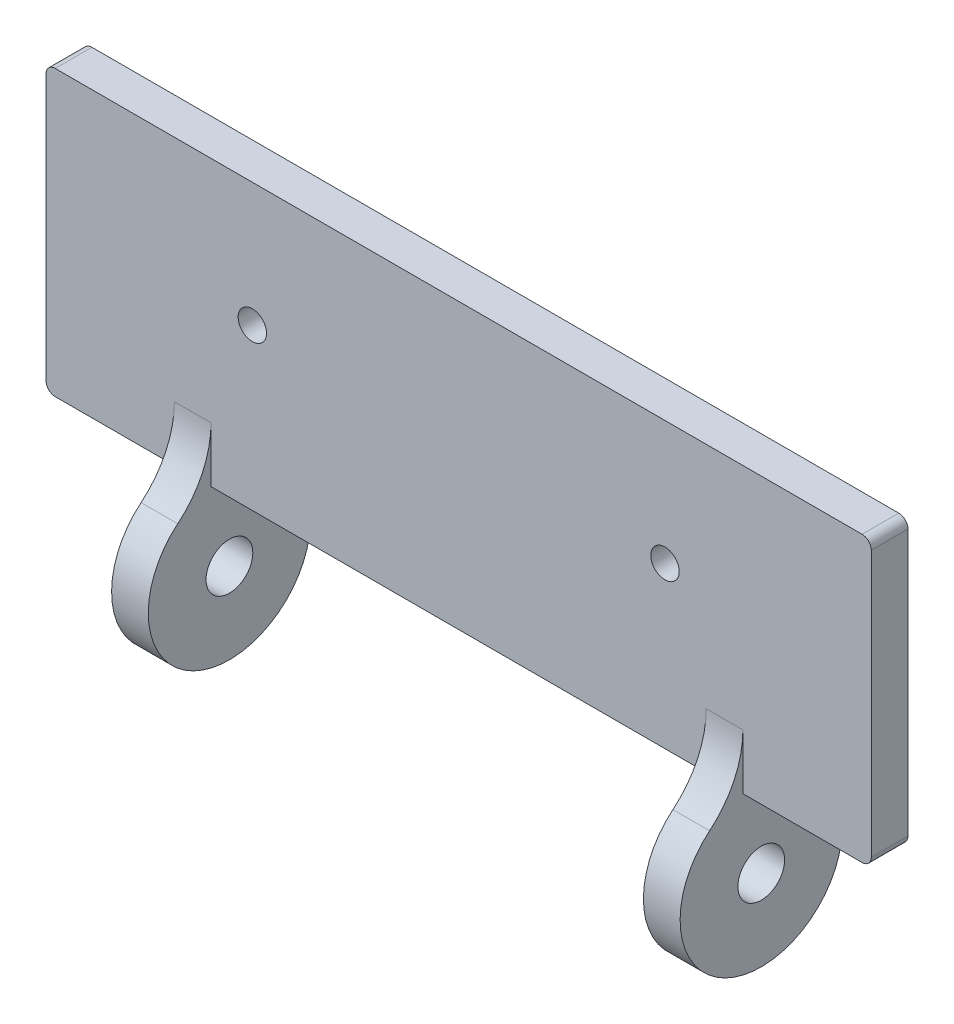
ISO-10303-21;
HEADER;
FILE_DESCRIPTION(('STEP AP214'),'2;1');
FILE_NAME('part.step','',(''),(''),'','','');
FILE_SCHEMA(('AUTOMOTIVE_DESIGN { 1 0 10303 214 1 1 1 1 }'));
ENDSEC;
DATA;
#1=APPLICATION_CONTEXT('core data for automotive mechanical design processes');
#2=APPLICATION_PROTOCOL_DEFINITION('international standard','automotive_design',2000,#1);
#3=PRODUCT_CONTEXT('',#1,'mechanical');
#4=PRODUCT('Part','Part','',(#3));
#5=PRODUCT_RELATED_PRODUCT_CATEGORY('part','',(#4));
#6=PRODUCT_DEFINITION_FORMATION('','',#4);
#7=PRODUCT_DEFINITION_CONTEXT('part definition',#1,'design');
#8=PRODUCT_DEFINITION('design','',#6,#7);
#9=PRODUCT_DEFINITION_SHAPE('','',#8);
#10=(LENGTH_UNIT() NAMED_UNIT(*) SI_UNIT(.MILLI.,.METRE.));
#11=(NAMED_UNIT(*) PLANE_ANGLE_UNIT() SI_UNIT($,.RADIAN.));
#12=(NAMED_UNIT(*) SI_UNIT($,.STERADIAN.) SOLID_ANGLE_UNIT());
#13=UNCERTAINTY_MEASURE_WITH_UNIT(LENGTH_MEASURE(1.E-05),#10,'distance_accuracy_value','');
#14=(GEOMETRIC_REPRESENTATION_CONTEXT(3) GLOBAL_UNCERTAINTY_ASSIGNED_CONTEXT((#13)) GLOBAL_UNIT_ASSIGNED_CONTEXT((#10,
#11,#12)) REPRESENTATION_CONTEXT('',''));
#15=CARTESIAN_POINT('',(0.,0.,0.));
#16=DIRECTION('',(0.,0.,1.));
#17=DIRECTION('',(1.,0.,0.));
#18=AXIS2_PLACEMENT_3D('',#15,#16,#17);
#19=CARTESIAN_POINT('',(40.9315281880334,-9.50897456248087,4.));
#20=DIRECTION('',(0.,1.,0.));
#21=DIRECTION('',(-1.,0.,0.));
#22=AXIS2_PLACEMENT_3D('',#19,#20,#21);
#23=PLANE('',#22);
#24=DIRECTION('',(1.,0.,0.));
#25=VECTOR('',#24,1.);
#26=CARTESIAN_POINT('',(40.9315281880334,-9.50897456248087,4.));
#27=LINE('',#26,#25);
#28=CARTESIAN_POINT('',(-48.0684718119666,-9.50897456248088,4.));
#29=VERTEX_POINT('',#28);
#30=CARTESIAN_POINT('',(-35.0684718119666,-9.50897456248088,4.));
#31=VERTEX_POINT('',#30);
#32=EDGE_CURVE('E343',#29,#31,#27,.T.);
#33=ORIENTED_EDGE('',*,*,#32,.F.);
#34=DIRECTION('',(0.,0.,-1.));
#35=VECTOR('',#34,1.);
#36=CARTESIAN_POINT('',(-48.0684718119666,-9.50897456248088,4.));
#37=LINE('',#36,#35);
#38=CARTESIAN_POINT('',(-48.0684718119666,-9.50897456248088,0.));
#39=VERTEX_POINT('',#38);
#40=EDGE_CURVE('E274',#29,#39,#37,.T.);
#41=ORIENTED_EDGE('',*,*,#40,.T.);
#42=DIRECTION('',(1.,0.,0.));
#43=VECTOR('',#42,1.);
#44=CARTESIAN_POINT('',(40.9315281880334,-9.50897456248087,0.));
#45=LINE('',#44,#43);
#46=CARTESIAN_POINT('',(-35.0684718119666,-9.50897456248088,0.));
#47=VERTEX_POINT('',#46);
#48=EDGE_CURVE('E192',#39,#47,#45,.T.);
#49=ORIENTED_EDGE('',*,*,#48,.T.);
#50=DIRECTION('',(0.,0.,-1.));
#51=VECTOR('',#50,1.);
#52=CARTESIAN_POINT('',(-35.0684718119666,-9.50897456248088,4.));
#53=LINE('',#52,#51);
#54=EDGE_CURVE('E401',#31,#47,#53,.T.);
#55=ORIENTED_EDGE('',*,*,#54,.F.);
#56=EDGE_LOOP('',(#33,#41,#49,#55));
#57=FACE_BOUND('',#56,.T.);
#58=ADVANCED_FACE('F40',(#57),#23,.F.);
#59=CARTESIAN_POINT('',(0.,0.,4.));
#60=DIRECTION('',(0.,0.,-1.));
#61=DIRECTION('',(-1.,0.,0.));
#62=AXIS2_PLACEMENT_3D('',#59,#60,#61);
#63=PLANE('',#62);
#64=CARTESIAN_POINT('',(-26.5684718119666,7.99102543751913,4.));
#65=DIRECTION('',(0.,0.,1.));
#66=DIRECTION('',(1.,0.,0.));
#67=AXIS2_PLACEMENT_3D('',#64,#65,#66);
#68=CIRCLE('',#67,1.55);
#69=CARTESIAN_POINT('',(-25.0184718119666,7.99102543751913,4.));
#70=VERTEX_POINT('',#69);
#71=EDGE_CURVE('E430',#70,#70,#68,.T.);
#72=ORIENTED_EDGE('',*,*,#71,.F.);
#73=EDGE_LOOP('',(#72));
#74=FACE_BOUND('',#73,.T.);
#75=CARTESIAN_POINT('',(18.4315281880334,7.99102543751913,4.));
#76=DIRECTION('',(0.,0.,1.));
#77=DIRECTION('',(1.,0.,0.));
#78=AXIS2_PLACEMENT_3D('',#75,#76,#77);
#79=CIRCLE('',#78,1.55);
#80=CARTESIAN_POINT('',(19.9815281880334,7.99102543751913,4.));
#81=VERTEX_POINT('',#80);
#82=EDGE_CURVE('E422',#81,#81,#79,.T.);
#83=ORIENTED_EDGE('',*,*,#82,.F.);
#84=EDGE_LOOP('',(#83));
#85=FACE_BOUND('',#84,.T.);
#86=DIRECTION('',(0.,-1.,0.));
#87=VECTOR('',#86,1.);
#88=CARTESIAN_POINT('',(-49.0684718119666,21.4910254375191,4.));
#89=LINE('',#88,#87);
#90=CARTESIAN_POINT('',(-49.0684718119666,20.4910254375191,4.));
#91=VERTEX_POINT('',#90);
#92=CARTESIAN_POINT('',(-49.0684718119666,-8.50897456248088,4.));
#93=VERTEX_POINT('',#92);
#94=EDGE_CURVE('E360',#91,#93,#89,.T.);
#95=ORIENTED_EDGE('',*,*,#94,.T.);
#96=CARTESIAN_POINT('',(-48.0684718119666,-8.50897456248088,4.));
#97=DIRECTION('',(0.,0.,-1.));
#98=DIRECTION('',(-1.,0.,0.));
#99=AXIS2_PLACEMENT_3D('',#96,#97,#98);
#100=CIRCLE('',#99,1.);
#101=EDGE_CURVE('E305',#93,#29,#100,.F.);
#102=ORIENTED_EDGE('',*,*,#101,.T.);
#103=ORIENTED_EDGE('',*,*,#32,.T.);
#104=DIRECTION('',(0.,-1.,0.));
#105=VECTOR('',#104,1.);
#106=CARTESIAN_POINT('',(-35.0684718119666,0.,4.));
#107=LINE('',#106,#105);
#108=CARTESIAN_POINT('',(-35.0684718119666,-3.48299043424948,4.));
#109=VERTEX_POINT('',#108);
#110=EDGE_CURVE('E394',#109,#31,#107,.T.);
#111=ORIENTED_EDGE('',*,*,#110,.F.);
#112=DIRECTION('',(1.,0.,0.));
#113=VECTOR('',#112,1.);
#114=CARTESIAN_POINT('',(0.,-3.48299043424947,4.));
#115=LINE('',#114,#113);
#116=CARTESIAN_POINT('',(-31.0684718119666,-3.48299043424948,4.));
#117=VERTEX_POINT('',#116);
#118=EDGE_CURVE('E215',#109,#117,#115,.T.);
#119=ORIENTED_EDGE('',*,*,#118,.T.);
#120=DIRECTION('',(0.,-1.,0.));
#121=VECTOR('',#120,1.);
#122=CARTESIAN_POINT('',(-31.0684718119666,0.,4.));
#123=LINE('',#122,#121);
#124=CARTESIAN_POINT('',(-31.0684718119666,-9.50897456248088,4.));
#125=VERTEX_POINT('',#124);
#126=EDGE_CURVE('E202',#117,#125,#123,.T.);
#127=ORIENTED_EDGE('',*,*,#126,.T.);
#128=CARTESIAN_POINT('',(22.9315281880334,-9.50897456248087,4.));
#129=VERTEX_POINT('',#128);
#130=EDGE_CURVE('E199',#125,#129,#27,.T.);
#131=ORIENTED_EDGE('',*,*,#130,.T.);
#132=DIRECTION('',(0.,-1.,0.));
#133=VECTOR('',#132,1.);
#134=CARTESIAN_POINT('',(22.9315281880334,0.,4.));
#135=LINE('',#134,#133);
#136=CARTESIAN_POINT('',(22.9315281880334,-3.48299043424947,4.));
#137=VERTEX_POINT('',#136);
#138=EDGE_CURVE('E333',#137,#129,#135,.T.);
#139=ORIENTED_EDGE('',*,*,#138,.F.);
#140=DIRECTION('',(1.,0.,0.));
#141=VECTOR('',#140,1.);
#142=CARTESIAN_POINT('',(0.,-3.48299043424948,4.));
#143=LINE('',#142,#141);
#144=CARTESIAN_POINT('',(26.9315281880334,-3.48299043424947,4.));
#145=VERTEX_POINT('',#144);
#146=EDGE_CURVE('E224',#137,#145,#143,.T.);
#147=ORIENTED_EDGE('',*,*,#146,.T.);
#148=DIRECTION('',(0.,-1.,0.));
#149=VECTOR('',#148,1.);
#150=CARTESIAN_POINT('',(26.9315281880334,0.,4.));
#151=LINE('',#150,#149);
#152=CARTESIAN_POINT('',(26.9315281880334,-9.50897456248087,4.));
#153=VERTEX_POINT('',#152);
#154=EDGE_CURVE('E374',#145,#153,#151,.T.);
#155=ORIENTED_EDGE('',*,*,#154,.T.);
#156=CARTESIAN_POINT('',(39.9315281880334,-9.50897456248087,4.));
#157=VERTEX_POINT('',#156);
#158=EDGE_CURVE('E354',#153,#157,#27,.T.);
#159=ORIENTED_EDGE('',*,*,#158,.T.);
#160=CARTESIAN_POINT('',(39.9315281880334,-8.50897456248087,4.));
#161=DIRECTION('',(0.,0.,-1.));
#162=DIRECTION('',(-1.,0.,0.));
#163=AXIS2_PLACEMENT_3D('',#160,#161,#162);
#164=CIRCLE('',#163,1.);
#165=CARTESIAN_POINT('',(40.9315281880334,-8.50897456248087,4.));
#166=VERTEX_POINT('',#165);
#167=EDGE_CURVE('E299',#157,#166,#164,.F.);
#168=ORIENTED_EDGE('',*,*,#167,.T.);
#169=DIRECTION('',(0.,1.,0.));
#170=VECTOR('',#169,1.);
#171=CARTESIAN_POINT('',(40.9315281880334,21.4910254375191,4.));
#172=LINE('',#171,#170);
#173=CARTESIAN_POINT('',(40.9315281880334,20.4910254375191,4.));
#174=VERTEX_POINT('',#173);
#175=EDGE_CURVE('E326',#166,#174,#172,.T.);
#176=ORIENTED_EDGE('',*,*,#175,.T.);
#177=CARTESIAN_POINT('',(39.9315281880334,20.4910254375191,4.));
#178=DIRECTION('',(0.,0.,-1.));
#179=DIRECTION('',(-1.,0.,0.));
#180=AXIS2_PLACEMENT_3D('',#177,#178,#179);
#181=CIRCLE('',#180,1.);
#182=CARTESIAN_POINT('',(39.9315281880334,21.4910254375191,4.));
#183=VERTEX_POINT('',#182);
#184=EDGE_CURVE('E63',#174,#183,#181,.F.);
#185=ORIENTED_EDGE('',*,*,#184,.T.);
#186=DIRECTION('',(-1.,0.,0.));
#187=VECTOR('',#186,1.);
#188=CARTESIAN_POINT('',(40.9315281880334,21.4910254375191,4.));
#189=LINE('',#188,#187);
#190=CARTESIAN_POINT('',(-48.0684718119666,21.4910254375191,4.));
#191=VERTEX_POINT('',#190);
#192=EDGE_CURVE('E364',#183,#191,#189,.T.);
#193=ORIENTED_EDGE('',*,*,#192,.T.);
#194=CARTESIAN_POINT('',(-48.0684718119666,20.4910254375191,4.));
#195=DIRECTION('',(0.,0.,-1.));
#196=DIRECTION('',(-1.,0.,0.));
#197=AXIS2_PLACEMENT_3D('',#194,#195,#196);
#198=CIRCLE('',#197,1.);
#199=EDGE_CURVE('E302',#191,#91,#198,.F.);
#200=ORIENTED_EDGE('',*,*,#199,.T.);
#201=EDGE_LOOP('',(#95,#102,#103,#111,#119,#127,#131,#139,#147,#155,#159,#168,#176,#185,#193,#200));
#202=FACE_BOUND('',#201,.T.);
#203=ADVANCED_FACE('F448',(#74,#85,#202),#63,.F.);
#204=CARTESIAN_POINT('',(0.,0.,0.));
#205=DIRECTION('',(0.,0.,-1.));
#206=DIRECTION('',(-1.,0.,0.));
#207=AXIS2_PLACEMENT_3D('',#204,#205,#206);
#208=PLANE('',#207);
#209=CARTESIAN_POINT('',(-26.5684718119666,7.99102543751913,0.));
#210=DIRECTION('',(0.,0.,1.));
#211=DIRECTION('',(1.,0.,0.));
#212=AXIS2_PLACEMENT_3D('',#209,#210,#211);
#213=CIRCLE('',#212,1.55);
#214=CARTESIAN_POINT('',(-25.0184718119666,7.99102543751913,0.));
#215=VERTEX_POINT('',#214);
#216=EDGE_CURVE('E418',#215,#215,#213,.T.);
#217=ORIENTED_EDGE('',*,*,#216,.T.);
#218=EDGE_LOOP('',(#217));
#219=FACE_BOUND('',#218,.T.);
#220=CARTESIAN_POINT('',(18.4315281880334,7.99102543751913,0.));
#221=DIRECTION('',(0.,0.,1.));
#222=DIRECTION('',(1.,0.,0.));
#223=AXIS2_PLACEMENT_3D('',#220,#221,#222);
#224=CIRCLE('',#223,1.55);
#225=CARTESIAN_POINT('',(19.9815281880334,7.99102543751913,0.));
#226=VERTEX_POINT('',#225);
#227=EDGE_CURVE('E426',#226,#226,#224,.T.);
#228=ORIENTED_EDGE('',*,*,#227,.T.);
#229=EDGE_LOOP('',(#228));
#230=FACE_BOUND('',#229,.T.);
#231=ORIENTED_EDGE('',*,*,#48,.F.);
#232=CARTESIAN_POINT('',(-48.0684718119666,-8.50897456248088,0.));
#233=DIRECTION('',(0.,0.,-1.));
#234=DIRECTION('',(-1.,0.,0.));
#235=AXIS2_PLACEMENT_3D('',#232,#233,#234);
#236=CIRCLE('',#235,1.);
#237=CARTESIAN_POINT('',(-49.0684718119666,-8.50897456248088,0.));
#238=VERTEX_POINT('',#237);
#239=EDGE_CURVE('E287',#39,#238,#236,.T.);
#240=ORIENTED_EDGE('',*,*,#239,.T.);
#241=DIRECTION('',(0.,-1.,0.));
#242=VECTOR('',#241,1.);
#243=CARTESIAN_POINT('',(-49.0684718119666,21.4910254375191,0.));
#244=LINE('',#243,#242);
#245=CARTESIAN_POINT('',(-49.0684718119666,20.4910254375191,0.));
#246=VERTEX_POINT('',#245);
#247=EDGE_CURVE('E337',#246,#238,#244,.T.);
#248=ORIENTED_EDGE('',*,*,#247,.F.);
#249=CARTESIAN_POINT('',(-48.0684718119666,20.4910254375191,0.));
#250=DIRECTION('',(0.,0.,-1.));
#251=DIRECTION('',(-1.,0.,0.));
#252=AXIS2_PLACEMENT_3D('',#249,#250,#251);
#253=CIRCLE('',#252,1.);
#254=CARTESIAN_POINT('',(-48.0684718119666,21.4910254375191,0.));
#255=VERTEX_POINT('',#254);
#256=EDGE_CURVE('E284',#246,#255,#253,.T.);
#257=ORIENTED_EDGE('',*,*,#256,.T.);
#258=DIRECTION('',(-1.,0.,0.));
#259=VECTOR('',#258,1.);
#260=CARTESIAN_POINT('',(40.9315281880334,21.4910254375191,0.));
#261=LINE('',#260,#259);
#262=CARTESIAN_POINT('',(39.9315281880334,21.4910254375191,0.));
#263=VERTEX_POINT('',#262);
#264=EDGE_CURVE('E332',#263,#255,#261,.T.);
#265=ORIENTED_EDGE('',*,*,#264,.F.);
#266=CARTESIAN_POINT('',(39.9315281880334,20.4910254375191,0.));
#267=DIRECTION('',(0.,0.,-1.));
#268=DIRECTION('',(-1.,0.,0.));
#269=AXIS2_PLACEMENT_3D('',#266,#267,#268);
#270=CIRCLE('',#269,1.);
#271=CARTESIAN_POINT('',(40.9315281880334,20.4910254375191,0.));
#272=VERTEX_POINT('',#271);
#273=EDGE_CURVE('E278',#263,#272,#270,.T.);
#274=ORIENTED_EDGE('',*,*,#273,.T.);
#275=DIRECTION('',(0.,1.,0.));
#276=VECTOR('',#275,1.);
#277=CARTESIAN_POINT('',(40.9315281880334,21.4910254375191,0.));
#278=LINE('',#277,#276);
#279=CARTESIAN_POINT('',(40.9315281880334,-8.50897456248087,0.));
#280=VERTEX_POINT('',#279);
#281=EDGE_CURVE('E324',#280,#272,#278,.T.);
#282=ORIENTED_EDGE('',*,*,#281,.F.);
#283=CARTESIAN_POINT('',(39.9315281880334,-8.50897456248087,0.));
#284=DIRECTION('',(0.,0.,-1.));
#285=DIRECTION('',(-1.,0.,0.));
#286=AXIS2_PLACEMENT_3D('',#283,#284,#285);
#287=CIRCLE('',#286,1.);
#288=CARTESIAN_POINT('',(39.9315281880334,-9.50897456248087,0.));
#289=VERTEX_POINT('',#288);
#290=EDGE_CURVE('E281',#280,#289,#287,.T.);
#291=ORIENTED_EDGE('',*,*,#290,.T.);
#292=CARTESIAN_POINT('',(26.9315281880334,-9.50897456248088,0.));
#293=VERTEX_POINT('',#292);
#294=EDGE_CURVE('E193',#293,#289,#45,.T.);
#295=ORIENTED_EDGE('',*,*,#294,.F.);
#296=DIRECTION('',(0.,-1.,0.));
#297=VECTOR('',#296,1.);
#298=CARTESIAN_POINT('',(26.9315281880334,0.,0.));
#299=LINE('',#298,#297);
#300=CARTESIAN_POINT('',(26.9315281880334,-7.93416886545859,0.));
#301=VERTEX_POINT('',#300);
#302=EDGE_CURVE('E217',#301,#293,#299,.T.);
#303=ORIENTED_EDGE('',*,*,#302,.F.);
#304=DIRECTION('',(-1.,0.,0.));
#305=VECTOR('',#304,1.);
#306=CARTESIAN_POINT('',(22.9315281880334,-7.93416886545859,0.));
#307=LINE('',#306,#305);
#308=CARTESIAN_POINT('',(22.9315281880334,-7.93416886545859,0.));
#309=VERTEX_POINT('',#308);
#310=EDGE_CURVE('E252',#301,#309,#307,.T.);
#311=ORIENTED_EDGE('',*,*,#310,.T.);
#312=DIRECTION('',(0.,-1.,0.));
#313=VECTOR('',#312,1.);
#314=CARTESIAN_POINT('',(22.9315281880334,0.,0.));
#315=LINE('',#314,#313);
#316=CARTESIAN_POINT('',(22.9315281880334,-9.50897456248087,0.));
#317=VERTEX_POINT('',#316);
#318=EDGE_CURVE('E187',#309,#317,#315,.T.);
#319=ORIENTED_EDGE('',*,*,#318,.T.);
#320=CARTESIAN_POINT('',(-31.0684718119666,-9.50897456248088,0.));
#321=VERTEX_POINT('',#320);
#322=EDGE_CURVE('E178',#321,#317,#45,.T.);
#323=ORIENTED_EDGE('',*,*,#322,.F.);
#324=DIRECTION('',(0.,-1.,0.));
#325=VECTOR('',#324,1.);
#326=CARTESIAN_POINT('',(-31.0684718119666,0.,0.));
#327=LINE('',#326,#325);
#328=CARTESIAN_POINT('',(-31.0684718119666,-7.93416886545859,0.));
#329=VERTEX_POINT('',#328);
#330=EDGE_CURVE('E184',#329,#321,#327,.T.);
#331=ORIENTED_EDGE('',*,*,#330,.F.);
#332=DIRECTION('',(-1.,0.,0.));
#333=VECTOR('',#332,1.);
#334=CARTESIAN_POINT('',(-35.0684718119666,-7.9341688654586,0.));
#335=LINE('',#334,#333);
#336=CARTESIAN_POINT('',(-35.0684718119666,-7.9341688654586,0.));
#337=VERTEX_POINT('',#336);
#338=EDGE_CURVE('E255',#329,#337,#335,.T.);
#339=ORIENTED_EDGE('',*,*,#338,.T.);
#340=DIRECTION('',(0.,-1.,0.));
#341=VECTOR('',#340,1.);
#342=CARTESIAN_POINT('',(-35.0684718119666,0.,0.));
#343=LINE('',#342,#341);
#344=EDGE_CURVE('E210',#337,#47,#343,.T.);
#345=ORIENTED_EDGE('',*,*,#344,.T.);
#346=EDGE_LOOP('',(#231,#240,#248,#257,#265,#274,#282,#291,#295,#303,#311,#319,#323,#331,#339,#345));
#347=FACE_BOUND('',#346,.T.);
#348=ADVANCED_FACE('F181',(#219,#230,#347),#208,.T.);
#349=ORIENTED_EDGE('',*,*,#130,.F.);
#350=DIRECTION('',(0.,0.,-1.));
#351=VECTOR('',#350,1.);
#352=CARTESIAN_POINT('',(-31.0684718119666,-9.50897456248088,4.));
#353=LINE('',#352,#351);
#354=EDGE_CURVE('E197',#125,#321,#353,.T.);
#355=ORIENTED_EDGE('',*,*,#354,.T.);
#356=ORIENTED_EDGE('',*,*,#322,.T.);
#357=DIRECTION('',(0.,0.,-1.));
#358=VECTOR('',#357,1.);
#359=CARTESIAN_POINT('',(22.9315281880334,-9.50897456248087,4.));
#360=LINE('',#359,#358);
#361=EDGE_CURVE('E340',#129,#317,#360,.T.);
#362=ORIENTED_EDGE('',*,*,#361,.F.);
#363=EDGE_LOOP('',(#349,#355,#356,#362));
#364=FACE_BOUND('',#363,.T.);
#365=ADVANCED_FACE('F198',(#364),#23,.F.);
#366=CARTESIAN_POINT('',(40.9315281880334,21.4910254375191,4.));
#367=DIRECTION('',(-1.,0.,0.));
#368=DIRECTION('',(0.,-1.,0.));
#369=AXIS2_PLACEMENT_3D('',#366,#367,#368);
#370=PLANE('',#369);
#371=ORIENTED_EDGE('',*,*,#175,.F.);
#372=DIRECTION('',(0.,0.,-1.));
#373=VECTOR('',#372,1.);
#374=CARTESIAN_POINT('',(40.9315281880334,-8.50897456248087,4.));
#375=LINE('',#374,#373);
#376=EDGE_CURVE('E49',#166,#280,#375,.T.);
#377=ORIENTED_EDGE('',*,*,#376,.T.);
#378=ORIENTED_EDGE('',*,*,#281,.T.);
#379=DIRECTION('',(0.,0.,-1.));
#380=VECTOR('',#379,1.);
#381=CARTESIAN_POINT('',(40.9315281880334,20.4910254375191,4.));
#382=LINE('',#381,#380);
#383=EDGE_CURVE('E314',#272,#174,#382,.F.);
#384=ORIENTED_EDGE('',*,*,#383,.T.);
#385=EDGE_LOOP('',(#371,#377,#378,#384));
#386=FACE_BOUND('',#385,.T.);
#387=ADVANCED_FACE('F323',(#386),#370,.F.);
#388=CARTESIAN_POINT('',(40.9315281880334,21.4910254375191,4.));
#389=DIRECTION('',(0.,-1.,0.));
#390=DIRECTION('',(1.,0.,0.));
#391=AXIS2_PLACEMENT_3D('',#388,#389,#390);
#392=PLANE('',#391);
#393=ORIENTED_EDGE('',*,*,#264,.T.);
#394=DIRECTION('',(0.,0.,-1.));
#395=VECTOR('',#394,1.);
#396=CARTESIAN_POINT('',(-48.0684718119666,21.4910254375191,4.));
#397=LINE('',#396,#395);
#398=EDGE_CURVE('E56',#255,#191,#397,.F.);
#399=ORIENTED_EDGE('',*,*,#398,.T.);
#400=ORIENTED_EDGE('',*,*,#192,.F.);
#401=DIRECTION('',(0.,0.,-1.));
#402=VECTOR('',#401,1.);
#403=CARTESIAN_POINT('',(39.9315281880334,21.4910254375191,4.));
#404=LINE('',#403,#402);
#405=EDGE_CURVE('E308',#183,#263,#404,.T.);
#406=ORIENTED_EDGE('',*,*,#405,.T.);
#407=EDGE_LOOP('',(#393,#399,#400,#406));
#408=FACE_BOUND('',#407,.T.);
#409=ADVANCED_FACE('F486',(#408),#392,.F.);
#410=CARTESIAN_POINT('',(-49.0684718119666,21.4910254375191,4.));
#411=DIRECTION('',(1.,0.,0.));
#412=DIRECTION('',(0.,1.,0.));
#413=AXIS2_PLACEMENT_3D('',#410,#411,#412);
#414=PLANE('',#413);
#415=ORIENTED_EDGE('',*,*,#247,.T.);
#416=DIRECTION('',(0.,0.,-1.));
#417=VECTOR('',#416,1.);
#418=CARTESIAN_POINT('',(-49.0684718119666,-8.50897456248088,4.));
#419=LINE('',#418,#417);
#420=EDGE_CURVE('E294',#238,#93,#419,.F.);
#421=ORIENTED_EDGE('',*,*,#420,.T.);
#422=ORIENTED_EDGE('',*,*,#94,.F.);
#423=DIRECTION('',(0.,0.,-1.));
#424=VECTOR('',#423,1.);
#425=CARTESIAN_POINT('',(-49.0684718119666,20.4910254375191,4.));
#426=LINE('',#425,#424);
#427=EDGE_CURVE('E290',#91,#246,#426,.T.);
#428=ORIENTED_EDGE('',*,*,#427,.T.);
#429=EDGE_LOOP('',(#415,#421,#422,#428));
#430=FACE_BOUND('',#429,.T.);
#431=ADVANCED_FACE('F477',(#430),#414,.F.);
#432=ORIENTED_EDGE('',*,*,#294,.T.);
#433=DIRECTION('',(0.,0.,-1.));
#434=VECTOR('',#433,1.);
#435=CARTESIAN_POINT('',(39.9315281880334,-9.50897456248087,4.));
#436=LINE('',#435,#434);
#437=EDGE_CURVE('E11',#289,#157,#436,.F.);
#438=ORIENTED_EDGE('',*,*,#437,.T.);
#439=ORIENTED_EDGE('',*,*,#158,.F.);
#440=DIRECTION('',(0.,0.,-1.));
#441=VECTOR('',#440,1.);
#442=CARTESIAN_POINT('',(26.9315281880334,-9.50897456248087,4.));
#443=LINE('',#442,#441);
#444=EDGE_CURVE('E377',#153,#293,#443,.T.);
#445=ORIENTED_EDGE('',*,*,#444,.T.);
#446=EDGE_LOOP('',(#432,#438,#439,#445));
#447=FACE_BOUND('',#446,.T.);
#448=ADVANCED_FACE('F469',(#447),#23,.F.);
#449=CARTESIAN_POINT('',(22.9315281880334,-18.0199261498671,2.00000000000001));
#450=DIRECTION('',(1.,0.,0.));
#451=DIRECTION('',(0.,1.,0.));
#452=AXIS2_PLACEMENT_3D('',#449,#450,#451);
#453=CYLINDRICAL_SURFACE('',#452,8.85);
#454=CARTESIAN_POINT('',(22.9315281880334,-18.0199261498671,2.00000000000001));
#455=DIRECTION('',(1.,0.,0.));
#456=DIRECTION('',(0.,1.,0.));
#457=AXIS2_PLACEMENT_3D('',#454,#455,#456);
#458=CIRCLE('',#457,8.85);
#459=CARTESIAN_POINT('',(22.9315281880334,-11.1948926706514,7.63395225464191));
#460=VERTEX_POINT('',#459);
#461=CARTESIAN_POINT('',(22.9315281880334,-9.79329463216984,-1.26267281105991));
#462=VERTEX_POINT('',#461);
#463=EDGE_CURVE('E381',#460,#462,#458,.T.);
#464=ORIENTED_EDGE('',*,*,#463,.T.);
#465=DIRECTION('',(1.,0.,0.));
#466=VECTOR('',#465,1.);
#467=CARTESIAN_POINT('',(22.9315281880334,-9.79329463216984,-1.26267281105991));
#468=LINE('',#467,#466);
#469=CARTESIAN_POINT('',(26.9315281880334,-9.79329463216984,-1.26267281105991));
#470=VERTEX_POINT('',#469);
#471=EDGE_CURVE('E258',#462,#470,#468,.T.);
#472=ORIENTED_EDGE('',*,*,#471,.T.);
#473=CARTESIAN_POINT('',(26.9315281880334,-18.0199261498671,2.00000000000001));
#474=DIRECTION('',(1.,0.,0.));
#475=DIRECTION('',(0.,1.,0.));
#476=AXIS2_PLACEMENT_3D('',#473,#474,#475);
#477=CIRCLE('',#476,8.85);
#478=CARTESIAN_POINT('',(26.9315281880334,-11.1948926706514,7.63395225464191));
#479=VERTEX_POINT('',#478);
#480=EDGE_CURVE('E382',#479,#470,#477,.T.);
#481=ORIENTED_EDGE('',*,*,#480,.F.);
#482=DIRECTION('',(1.,0.,0.));
#483=VECTOR('',#482,1.);
#484=CARTESIAN_POINT('',(22.9315281880334,-11.1948926706514,7.63395225464192));
#485=LINE('',#484,#483);
#486=EDGE_CURVE('E228',#479,#460,#485,.F.);
#487=ORIENTED_EDGE('',*,*,#486,.T.);
#488=EDGE_LOOP('',(#464,#472,#481,#487));
#489=FACE_BOUND('',#488,.T.);
#490=ADVANCED_FACE('F476',(#489),#453,.T.);
#491=CARTESIAN_POINT('',(22.9315281880334,-18.0199261498671,2.00000000000001));
#492=DIRECTION('',(1.,0.,0.));
#493=DIRECTION('',(0.,1.,0.));
#494=AXIS2_PLACEMENT_3D('',#491,#492,#493);
#495=PLANE('',#494);
#496=CARTESIAN_POINT('',(22.9315281880334,-18.0199261498671,2.00000000000001));
#497=DIRECTION('',(1.,0.,0.));
#498=DIRECTION('',(0.,1.,0.));
#499=AXIS2_PLACEMENT_3D('',#496,#497,#498);
#500=CIRCLE('',#499,2.55);
#501=CARTESIAN_POINT('',(22.9315281880334,-15.4699261498671,2.00000000000001));
#502=VERTEX_POINT('',#501);
#503=EDGE_CURVE('E386',#502,#502,#500,.T.);
#504=ORIENTED_EDGE('',*,*,#503,.T.);
#505=EDGE_LOOP('',(#504));
#506=FACE_BOUND('',#505,.T.);
#507=ORIENTED_EDGE('',*,*,#463,.F.);
#508=CARTESIAN_POINT('',(22.9315281880334,-3.48299043424947,14.));
#509=DIRECTION('',(1.,0.,0.));
#510=DIRECTION('',(0.,1.,0.));
#511=AXIS2_PLACEMENT_3D('',#508,#509,#510);
#512=CIRCLE('',#511,10.);
#513=EDGE_CURVE('E237',#460,#137,#512,.T.);
#514=ORIENTED_EDGE('',*,*,#513,.T.);
#515=ORIENTED_EDGE('',*,*,#138,.T.);
#516=ORIENTED_EDGE('',*,*,#361,.T.);
#517=ORIENTED_EDGE('',*,*,#318,.F.);
#518=CARTESIAN_POINT('',(22.9315281880334,-7.93416886545859,-2.));
#519=DIRECTION('',(1.,0.,0.));
#520=DIRECTION('',(0.,1.,0.));
#521=AXIS2_PLACEMENT_3D('',#518,#519,#520);
#522=CIRCLE('',#521,2.);
#523=EDGE_CURVE('E271',#309,#462,#522,.T.);
#524=ORIENTED_EDGE('',*,*,#523,.T.);
#525=EDGE_LOOP('',(#507,#514,#515,#516,#517,#524));
#526=FACE_BOUND('',#525,.T.);
#527=ADVANCED_FACE('F483',(#506,#526),#495,.F.);
#528=CARTESIAN_POINT('',(26.9315281880334,-18.0199261498671,2.00000000000001));
#529=DIRECTION('',(1.,0.,0.));
#530=DIRECTION('',(0.,1.,0.));
#531=AXIS2_PLACEMENT_3D('',#528,#529,#530);
#532=PLANE('',#531);
#533=CARTESIAN_POINT('',(26.9315281880334,-18.0199261498671,2.00000000000001));
#534=DIRECTION('',(1.,0.,0.));
#535=DIRECTION('',(0.,1.,0.));
#536=AXIS2_PLACEMENT_3D('',#533,#534,#535);
#537=CIRCLE('',#536,2.55);
#538=CARTESIAN_POINT('',(26.9315281880334,-15.4699261498671,2.00000000000001));
#539=VERTEX_POINT('',#538);
#540=EDGE_CURVE('E390',#539,#539,#537,.T.);
#541=ORIENTED_EDGE('',*,*,#540,.F.);
#542=EDGE_LOOP('',(#541));
#543=FACE_BOUND('',#542,.T.);
#544=ORIENTED_EDGE('',*,*,#154,.F.);
#545=CARTESIAN_POINT('',(26.9315281880334,-3.48299043424947,14.));
#546=DIRECTION('',(1.,0.,0.));
#547=DIRECTION('',(0.,1.,0.));
#548=AXIS2_PLACEMENT_3D('',#545,#546,#547);
#549=CIRCLE('',#548,10.);
#550=EDGE_CURVE('E234',#145,#479,#549,.F.);
#551=ORIENTED_EDGE('',*,*,#550,.T.);
#552=ORIENTED_EDGE('',*,*,#480,.T.);
#553=CARTESIAN_POINT('',(26.9315281880334,-7.93416886545859,-2.));
#554=DIRECTION('',(1.,0.,0.));
#555=DIRECTION('',(0.,1.,0.));
#556=AXIS2_PLACEMENT_3D('',#553,#554,#555);
#557=CIRCLE('',#556,2.);
#558=EDGE_CURVE('E267',#470,#301,#557,.F.);
#559=ORIENTED_EDGE('',*,*,#558,.T.);
#560=ORIENTED_EDGE('',*,*,#302,.T.);
#561=ORIENTED_EDGE('',*,*,#444,.F.);
#562=EDGE_LOOP('',(#544,#551,#552,#559,#560,#561));
#563=FACE_BOUND('',#562,.T.);
#564=ADVANCED_FACE('F652',(#543,#563),#532,.T.);
#565=CARTESIAN_POINT('',(22.9315281880334,-18.0199261498671,2.00000000000001));
#566=DIRECTION('',(1.,0.,0.));
#567=DIRECTION('',(0.,1.,0.));
#568=AXIS2_PLACEMENT_3D('',#565,#566,#567);
#569=CYLINDRICAL_SURFACE('',#568,2.55);
#570=ORIENTED_EDGE('',*,*,#503,.F.);
#571=EDGE_LOOP('',(#570));
#572=FACE_BOUND('',#571,.T.);
#573=ORIENTED_EDGE('',*,*,#540,.T.);
#574=EDGE_LOOP('',(#573));
#575=FACE_BOUND('',#574,.T.);
#576=ADVANCED_FACE('F646',(#572,#575),#569,.F.);
#577=CARTESIAN_POINT('',(-35.0684718119666,-18.0199261498671,2.00000000000001));
#578=DIRECTION('',(1.,0.,0.));
#579=DIRECTION('',(0.,1.,0.));
#580=AXIS2_PLACEMENT_3D('',#577,#578,#579);
#581=CYLINDRICAL_SURFACE('',#580,8.85);
#582=CARTESIAN_POINT('',(-35.0684718119666,-18.0199261498671,2.00000000000001));
#583=DIRECTION('',(1.,0.,0.));
#584=DIRECTION('',(0.,1.,0.));
#585=AXIS2_PLACEMENT_3D('',#582,#583,#584);
#586=CIRCLE('',#585,8.85);
#587=CARTESIAN_POINT('',(-35.0684718119666,-11.1948926706514,7.63395225464191));
#588=VERTEX_POINT('',#587);
#589=CARTESIAN_POINT('',(-35.0684718119666,-9.79329463216984,-1.26267281105991));
#590=VERTEX_POINT('',#589);
#591=EDGE_CURVE('E203',#588,#590,#586,.T.);
#592=ORIENTED_EDGE('',*,*,#591,.T.);
#593=DIRECTION('',(1.,0.,0.));
#594=VECTOR('',#593,1.);
#595=CARTESIAN_POINT('',(-35.0684718119666,-9.79329463216984,-1.26267281105991));
#596=LINE('',#595,#594);
#597=CARTESIAN_POINT('',(-31.0684718119666,-9.79329463216984,-1.26267281105991));
#598=VERTEX_POINT('',#597);
#599=EDGE_CURVE('E248',#590,#598,#596,.T.);
#600=ORIENTED_EDGE('',*,*,#599,.T.);
#601=CARTESIAN_POINT('',(-31.0684718119666,-18.0199261498671,2.00000000000001));
#602=DIRECTION('',(1.,0.,0.));
#603=DIRECTION('',(0.,1.,0.));
#604=AXIS2_PLACEMENT_3D('',#601,#602,#603);
#605=CIRCLE('',#604,8.85);
#606=CARTESIAN_POINT('',(-31.0684718119666,-11.1948926706514,7.63395225464191));
#607=VERTEX_POINT('',#606);
#608=EDGE_CURVE('E407',#607,#598,#605,.T.);
#609=ORIENTED_EDGE('',*,*,#608,.F.);
#610=DIRECTION('',(1.,0.,0.));
#611=VECTOR('',#610,1.);
#612=CARTESIAN_POINT('',(-35.0684718119666,-11.1948926706514,7.63395225464192));
#613=LINE('',#612,#611);
#614=EDGE_CURVE('E231',#607,#588,#613,.F.);
#615=ORIENTED_EDGE('',*,*,#614,.T.);
#616=EDGE_LOOP('',(#592,#600,#609,#615));
#617=FACE_BOUND('',#616,.T.);
#618=ADVANCED_FACE('F512',(#617),#581,.T.);
#619=CARTESIAN_POINT('',(-35.0684718119666,-18.0199261498671,2.00000000000001));
#620=DIRECTION('',(1.,0.,0.));
#621=DIRECTION('',(0.,1.,0.));
#622=AXIS2_PLACEMENT_3D('',#619,#620,#621);
#623=PLANE('',#622);
#624=CARTESIAN_POINT('',(-35.0684718119666,-18.0199261498671,2.00000000000001));
#625=DIRECTION('',(1.,0.,0.));
#626=DIRECTION('',(0.,1.,0.));
#627=AXIS2_PLACEMENT_3D('',#624,#625,#626);
#628=CIRCLE('',#627,2.55);
#629=CARTESIAN_POINT('',(-35.0684718119666,-15.4699261498671,2.00000000000001));
#630=VERTEX_POINT('',#629);
#631=EDGE_CURVE('E410',#630,#630,#628,.T.);
#632=ORIENTED_EDGE('',*,*,#631,.T.);
#633=EDGE_LOOP('',(#632));
#634=FACE_BOUND('',#633,.T.);
#635=ORIENTED_EDGE('',*,*,#591,.F.);
#636=CARTESIAN_POINT('',(-35.0684718119666,-3.48299043424948,14.));
#637=DIRECTION('',(1.,0.,0.));
#638=DIRECTION('',(0.,1.,0.));
#639=AXIS2_PLACEMENT_3D('',#636,#637,#638);
#640=CIRCLE('',#639,10.);
#641=EDGE_CURVE('E244',#588,#109,#640,.T.);
#642=ORIENTED_EDGE('',*,*,#641,.T.);
#643=ORIENTED_EDGE('',*,*,#110,.T.);
#644=ORIENTED_EDGE('',*,*,#54,.T.);
#645=ORIENTED_EDGE('',*,*,#344,.F.);
#646=CARTESIAN_POINT('',(-35.0684718119666,-7.9341688654586,-2.));
#647=DIRECTION('',(1.,0.,0.));
#648=DIRECTION('',(0.,1.,0.));
#649=AXIS2_PLACEMENT_3D('',#646,#647,#648);
#650=CIRCLE('',#649,2.);
#651=EDGE_CURVE('E264',#337,#590,#650,.T.);
#652=ORIENTED_EDGE('',*,*,#651,.T.);
#653=EDGE_LOOP('',(#635,#642,#643,#644,#645,#652));
#654=FACE_BOUND('',#653,.T.);
#655=ADVANCED_FACE('F503',(#634,#654),#623,.F.);
#656=CARTESIAN_POINT('',(-31.0684718119666,-18.0199261498671,2.00000000000001));
#657=DIRECTION('',(1.,0.,0.));
#658=DIRECTION('',(0.,1.,0.));
#659=AXIS2_PLACEMENT_3D('',#656,#657,#658);
#660=PLANE('',#659);
#661=CARTESIAN_POINT('',(-31.0684718119666,-18.0199261498671,2.00000000000001));
#662=DIRECTION('',(1.,0.,0.));
#663=DIRECTION('',(0.,1.,0.));
#664=AXIS2_PLACEMENT_3D('',#661,#662,#663);
#665=CIRCLE('',#664,2.55);
#666=CARTESIAN_POINT('',(-31.0684718119666,-15.4699261498671,2.00000000000001));
#667=VERTEX_POINT('',#666);
#668=EDGE_CURVE('E414',#667,#667,#665,.T.);
#669=ORIENTED_EDGE('',*,*,#668,.F.);
#670=EDGE_LOOP('',(#669));
#671=FACE_BOUND('',#670,.T.);
#672=ORIENTED_EDGE('',*,*,#126,.F.);
#673=CARTESIAN_POINT('',(-31.0684718119666,-3.48299043424948,14.));
#674=DIRECTION('',(1.,0.,0.));
#675=DIRECTION('',(0.,1.,0.));
#676=AXIS2_PLACEMENT_3D('',#673,#674,#675);
#677=CIRCLE('',#676,10.);
#678=EDGE_CURVE('E241',#117,#607,#677,.F.);
#679=ORIENTED_EDGE('',*,*,#678,.T.);
#680=ORIENTED_EDGE('',*,*,#608,.T.);
#681=CARTESIAN_POINT('',(-31.0684718119666,-7.93416886545859,-2.));
#682=DIRECTION('',(1.,0.,0.));
#683=DIRECTION('',(0.,1.,0.));
#684=AXIS2_PLACEMENT_3D('',#681,#682,#683);
#685=CIRCLE('',#684,2.);
#686=EDGE_CURVE('E207',#598,#329,#685,.F.);
#687=ORIENTED_EDGE('',*,*,#686,.T.);
#688=ORIENTED_EDGE('',*,*,#330,.T.);
#689=ORIENTED_EDGE('',*,*,#354,.F.);
#690=EDGE_LOOP('',(#672,#679,#680,#687,#688,#689));
#691=FACE_BOUND('',#690,.T.);
#692=ADVANCED_FACE('F205',(#671,#691),#660,.T.);
#693=CARTESIAN_POINT('',(-35.0684718119666,-18.0199261498671,2.00000000000001));
#694=DIRECTION('',(1.,0.,0.));
#695=DIRECTION('',(0.,1.,0.));
#696=AXIS2_PLACEMENT_3D('',#693,#694,#695);
#697=CYLINDRICAL_SURFACE('',#696,2.55);
#698=ORIENTED_EDGE('',*,*,#631,.F.);
#699=EDGE_LOOP('',(#698));
#700=FACE_BOUND('',#699,.T.);
#701=ORIENTED_EDGE('',*,*,#668,.T.);
#702=EDGE_LOOP('',(#701));
#703=FACE_BOUND('',#702,.T.);
#704=ADVANCED_FACE('F626',(#700,#703),#697,.F.);
#705=CARTESIAN_POINT('',(22.9315281880334,-3.48299043424947,14.));
#706=DIRECTION('',(1.,0.,0.));
#707=DIRECTION('',(0.,1.,0.));
#708=AXIS2_PLACEMENT_3D('',#705,#706,#707);
#709=CYLINDRICAL_SURFACE('',#708,10.);
#710=ORIENTED_EDGE('',*,*,#513,.F.);
#711=ORIENTED_EDGE('',*,*,#486,.F.);
#712=ORIENTED_EDGE('',*,*,#550,.F.);
#713=ORIENTED_EDGE('',*,*,#146,.F.);
#714=EDGE_LOOP('',(#710,#711,#712,#713));
#715=FACE_BOUND('',#714,.T.);
#716=ADVANCED_FACE('F521',(#715),#709,.F.);
#717=CARTESIAN_POINT('',(-35.0684718119666,-3.48299043424948,14.));
#718=DIRECTION('',(1.,0.,0.));
#719=DIRECTION('',(0.,1.,0.));
#720=AXIS2_PLACEMENT_3D('',#717,#718,#719);
#721=CYLINDRICAL_SURFACE('',#720,10.);
#722=ORIENTED_EDGE('',*,*,#641,.F.);
#723=ORIENTED_EDGE('',*,*,#614,.F.);
#724=ORIENTED_EDGE('',*,*,#678,.F.);
#725=ORIENTED_EDGE('',*,*,#118,.F.);
#726=EDGE_LOOP('',(#722,#723,#724,#725));
#727=FACE_BOUND('',#726,.T.);
#728=ADVANCED_FACE('F508',(#727),#721,.F.);
#729=CARTESIAN_POINT('',(-35.0684718119666,-7.9341688654586,-2.));
#730=DIRECTION('',(1.,0.,0.));
#731=DIRECTION('',(0.,1.,0.));
#732=AXIS2_PLACEMENT_3D('',#729,#730,#731);
#733=CYLINDRICAL_SURFACE('',#732,2.);
#734=ORIENTED_EDGE('',*,*,#651,.F.);
#735=ORIENTED_EDGE('',*,*,#338,.F.);
#736=ORIENTED_EDGE('',*,*,#686,.F.);
#737=ORIENTED_EDGE('',*,*,#599,.F.);
#738=EDGE_LOOP('',(#734,#735,#736,#737));
#739=FACE_BOUND('',#738,.T.);
#740=ADVANCED_FACE('F461',(#739),#733,.F.);
#741=CARTESIAN_POINT('',(22.9315281880334,-7.93416886545859,-2.));
#742=DIRECTION('',(1.,0.,0.));
#743=DIRECTION('',(0.,1.,0.));
#744=AXIS2_PLACEMENT_3D('',#741,#742,#743);
#745=CYLINDRICAL_SURFACE('',#744,2.);
#746=ORIENTED_EDGE('',*,*,#523,.F.);
#747=ORIENTED_EDGE('',*,*,#310,.F.);
#748=ORIENTED_EDGE('',*,*,#558,.F.);
#749=ORIENTED_EDGE('',*,*,#471,.F.);
#750=EDGE_LOOP('',(#746,#747,#748,#749));
#751=FACE_BOUND('',#750,.T.);
#752=ADVANCED_FACE('F455',(#751),#745,.F.);
#753=CARTESIAN_POINT('',(18.4315281880334,7.99102543751913,0.));
#754=DIRECTION('',(0.,0.,1.));
#755=DIRECTION('',(1.,0.,0.));
#756=AXIS2_PLACEMENT_3D('',#753,#754,#755);
#757=CYLINDRICAL_SURFACE('',#756,1.55);
#758=ORIENTED_EDGE('',*,*,#227,.F.);
#759=EDGE_LOOP('',(#758));
#760=FACE_BOUND('',#759,.T.);
#761=ORIENTED_EDGE('',*,*,#82,.T.);
#762=EDGE_LOOP('',(#761));
#763=FACE_BOUND('',#762,.T.);
#764=ADVANCED_FACE('F444',(#760,#763),#757,.F.);
#765=CARTESIAN_POINT('',(-26.5684718119666,7.99102543751913,0.));
#766=DIRECTION('',(0.,0.,1.));
#767=DIRECTION('',(1.,0.,0.));
#768=AXIS2_PLACEMENT_3D('',#765,#766,#767);
#769=CYLINDRICAL_SURFACE('',#768,1.55);
#770=ORIENTED_EDGE('',*,*,#216,.F.);
#771=EDGE_LOOP('',(#770));
#772=FACE_BOUND('',#771,.T.);
#773=ORIENTED_EDGE('',*,*,#71,.T.);
#774=EDGE_LOOP('',(#773));
#775=FACE_BOUND('',#774,.T.);
#776=ADVANCED_FACE('F440',(#772,#775),#769,.F.);
#777=CARTESIAN_POINT('',(-48.0684718119666,-8.50897456248088,4.));
#778=DIRECTION('',(0.,0.,-1.));
#779=DIRECTION('',(-1.,0.,0.));
#780=AXIS2_PLACEMENT_3D('',#777,#778,#779);
#781=CYLINDRICAL_SURFACE('',#780,1.);
#782=ORIENTED_EDGE('',*,*,#101,.F.);
#783=ORIENTED_EDGE('',*,*,#420,.F.);
#784=ORIENTED_EDGE('',*,*,#239,.F.);
#785=ORIENTED_EDGE('',*,*,#40,.F.);
#786=EDGE_LOOP('',(#782,#783,#784,#785));
#787=FACE_BOUND('',#786,.T.);
#788=ADVANCED_FACE('F443',(#787),#781,.T.);
#789=CARTESIAN_POINT('',(-48.0684718119666,20.4910254375191,4.));
#790=DIRECTION('',(0.,0.,-1.));
#791=DIRECTION('',(-1.,0.,0.));
#792=AXIS2_PLACEMENT_3D('',#789,#790,#791);
#793=CYLINDRICAL_SURFACE('',#792,1.);
#794=ORIENTED_EDGE('',*,*,#199,.F.);
#795=ORIENTED_EDGE('',*,*,#398,.F.);
#796=ORIENTED_EDGE('',*,*,#256,.F.);
#797=ORIENTED_EDGE('',*,*,#427,.F.);
#798=EDGE_LOOP('',(#794,#795,#796,#797));
#799=FACE_BOUND('',#798,.T.);
#800=ADVANCED_FACE('F497',(#799),#793,.T.);
#801=CARTESIAN_POINT('',(39.9315281880334,-8.50897456248087,4.));
#802=DIRECTION('',(0.,0.,-1.));
#803=DIRECTION('',(-1.,0.,0.));
#804=AXIS2_PLACEMENT_3D('',#801,#802,#803);
#805=CYLINDRICAL_SURFACE('',#804,1.);
#806=ORIENTED_EDGE('',*,*,#167,.F.);
#807=ORIENTED_EDGE('',*,*,#437,.F.);
#808=ORIENTED_EDGE('',*,*,#290,.F.);
#809=ORIENTED_EDGE('',*,*,#376,.F.);
#810=EDGE_LOOP('',(#806,#807,#808,#809));
#811=FACE_BOUND('',#810,.T.);
#812=ADVANCED_FACE('F490',(#811),#805,.T.);
#813=CARTESIAN_POINT('',(39.9315281880334,20.4910254375191,4.));
#814=DIRECTION('',(0.,0.,-1.));
#815=DIRECTION('',(-1.,0.,0.));
#816=AXIS2_PLACEMENT_3D('',#813,#814,#815);
#817=CYLINDRICAL_SURFACE('',#816,1.);
#818=ORIENTED_EDGE('',*,*,#184,.F.);
#819=ORIENTED_EDGE('',*,*,#383,.F.);
#820=ORIENTED_EDGE('',*,*,#273,.F.);
#821=ORIENTED_EDGE('',*,*,#405,.F.);
#822=EDGE_LOOP('',(#818,#819,#820,#821));
#823=FACE_BOUND('',#822,.T.);
#824=ADVANCED_FACE('F42',(#823),#817,.T.);
#825=CLOSED_SHELL('',(#58,#203,#348,#365,#387,#409,#431,#448,#490,#527,#564,#576,#618,#655,#692,
#704,#716,#728,#740,#752,#764,#776,#788,#800,#812,#824));
#826=MANIFOLD_SOLID_BREP('B2',#825);
#827=ADVANCED_BREP_SHAPE_REPRESENTATION('',(#18,#826),#14);
#828=SHAPE_DEFINITION_REPRESENTATION(#9,#827);
ENDSEC;
END-ISO-10303-21;
